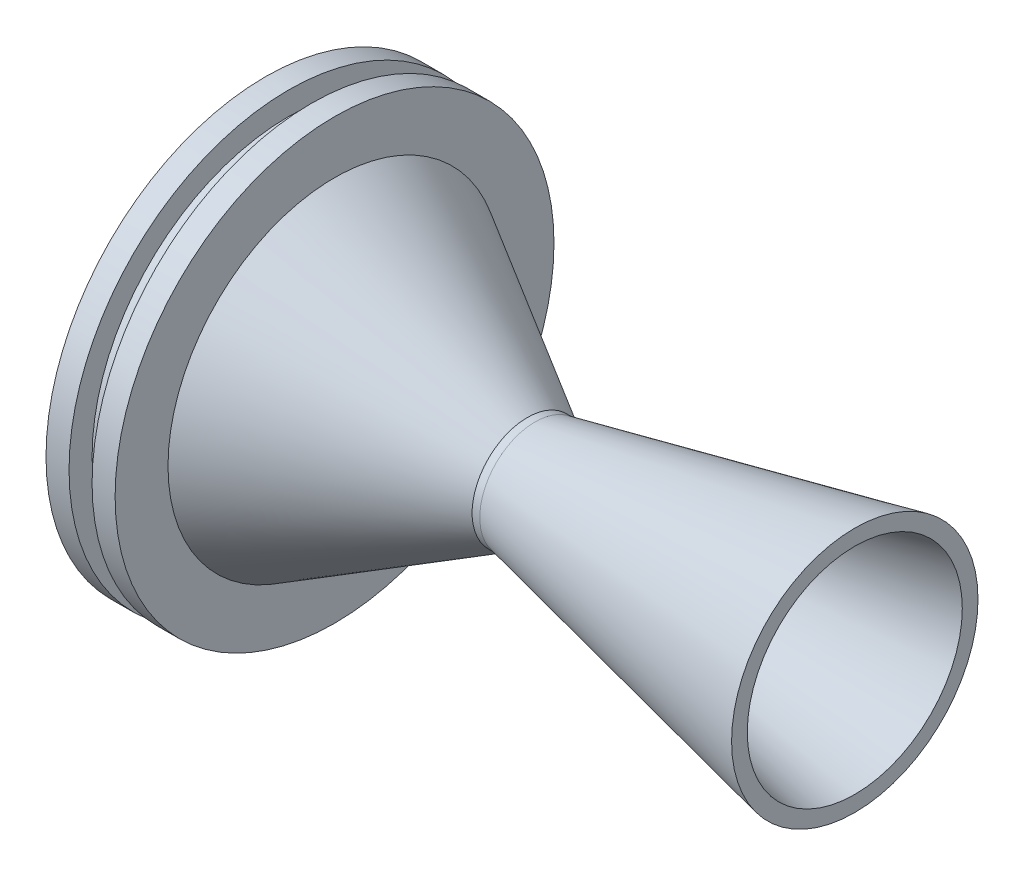
ISO-10303-21;
HEADER;
FILE_DESCRIPTION(('STEP AP214'),'2;1');
FILE_NAME('part.step','',(''),(''),'','','');
FILE_SCHEMA(('AUTOMOTIVE_DESIGN { 1 0 10303 214 1 1 1 1 }'));
ENDSEC;
DATA;
#1=APPLICATION_CONTEXT('core data for automotive mechanical design processes');
#2=APPLICATION_PROTOCOL_DEFINITION('international standard','automotive_design',2000,#1);
#3=PRODUCT_CONTEXT('',#1,'mechanical');
#4=PRODUCT('Part','Part','',(#3));
#5=PRODUCT_RELATED_PRODUCT_CATEGORY('part','',(#4));
#6=PRODUCT_DEFINITION_FORMATION('','',#4);
#7=PRODUCT_DEFINITION_CONTEXT('part definition',#1,'design');
#8=PRODUCT_DEFINITION('design','',#6,#7);
#9=PRODUCT_DEFINITION_SHAPE('','',#8);
#10=(LENGTH_UNIT() NAMED_UNIT(*) SI_UNIT(.MILLI.,.METRE.));
#11=(NAMED_UNIT(*) PLANE_ANGLE_UNIT() SI_UNIT($,.RADIAN.));
#12=(NAMED_UNIT(*) SI_UNIT($,.STERADIAN.) SOLID_ANGLE_UNIT());
#13=UNCERTAINTY_MEASURE_WITH_UNIT(LENGTH_MEASURE(1.E-05),#10,'distance_accuracy_value','');
#14=(GEOMETRIC_REPRESENTATION_CONTEXT(3) GLOBAL_UNCERTAINTY_ASSIGNED_CONTEXT((#13)) GLOBAL_UNIT_ASSIGNED_CONTEXT((#10,
#11,#12)) REPRESENTATION_CONTEXT('',''));
#15=CARTESIAN_POINT('',(0.,0.,0.));
#16=DIRECTION('',(0.,0.,1.));
#17=DIRECTION('',(1.,0.,0.));
#18=AXIS2_PLACEMENT_3D('',#15,#16,#17);
#19=CARTESIAN_POINT('',(0.,0.,0.));
#20=DIRECTION('',(1.,0.,0.));
#21=DIRECTION('',(0.,0.,-1.));
#22=AXIS2_PLACEMENT_3D('',#19,#20,#21);
#23=CYLINDRICAL_SURFACE('',#22,28.575);
#24=CARTESIAN_POINT('',(0.,0.,0.));
#25=DIRECTION('',(1.,0.,0.));
#26=DIRECTION('',(0.,0.,-1.));
#27=AXIS2_PLACEMENT_3D('',#24,#25,#26);
#28=CIRCLE('',#27,28.575);
#29=CARTESIAN_POINT('',(0.,0.,-28.575));
#30=VERTEX_POINT('',#29);
#31=EDGE_CURVE('E10',#30,#30,#28,.T.);
#32=ORIENTED_EDGE('',*,*,#31,.T.);
#33=EDGE_LOOP('',(#32));
#34=FACE_BOUND('',#33,.T.);
#35=CARTESIAN_POINT('',(3.,0.,0.));
#36=DIRECTION('',(1.,0.,0.));
#37=DIRECTION('',(0.,0.,-1.));
#38=AXIS2_PLACEMENT_3D('',#35,#36,#37);
#39=CIRCLE('',#38,28.575);
#40=CARTESIAN_POINT('',(3.,0.,-28.575));
#41=VERTEX_POINT('',#40);
#42=EDGE_CURVE('E85',#41,#41,#39,.T.);
#43=ORIENTED_EDGE('',*,*,#42,.F.);
#44=EDGE_LOOP('',(#43));
#45=FACE_BOUND('',#44,.T.);
#46=ADVANCED_FACE('F39',(#34,#45),#23,.T.);
#47=CARTESIAN_POINT('',(0.,28.575,0.));
#48=DIRECTION('',(-1.,0.,0.));
#49=DIRECTION('',(0.,0.,1.));
#50=AXIS2_PLACEMENT_3D('',#47,#48,#49);
#51=PLANE('',#50);
#52=CARTESIAN_POINT('',(0.,0.,0.));
#53=DIRECTION('',(1.,0.,0.));
#54=DIRECTION('',(0.,0.,-1.));
#55=AXIS2_PLACEMENT_3D('',#52,#53,#54);
#56=CIRCLE('',#55,24.575);
#57=CARTESIAN_POINT('',(0.,0.,-24.575));
#58=VERTEX_POINT('',#57);
#59=EDGE_CURVE('E45',#58,#58,#56,.T.);
#60=ORIENTED_EDGE('',*,*,#59,.T.);
#61=EDGE_LOOP('',(#60));
#62=FACE_BOUND('',#61,.T.);
#63=ORIENTED_EDGE('',*,*,#31,.F.);
#64=EDGE_LOOP('',(#63));
#65=FACE_BOUND('',#64,.T.);
#66=ADVANCED_FACE('F93',(#62,#65),#51,.T.);
#67=CARTESIAN_POINT('',(0.,0.,0.));
#68=DIRECTION('',(-1.,0.,0.));
#69=DIRECTION('',(0.,0.,1.));
#70=AXIS2_PLACEMENT_3D('',#67,#68,#69);
#71=CONICAL_SURFACE('',#70,24.575,0.523598775598301);
#72=CARTESIAN_POINT('',(33.9048945581615,0.,0.));
#73=DIRECTION('',(1.,0.,0.));
#74=DIRECTION('',(0.,0.,-1.));
#75=AXIS2_PLACEMENT_3D('',#72,#73,#74);
#76=CIRCLE('',#75,4.99999999999949);
#77=CARTESIAN_POINT('',(33.9048945581615,0.,-4.99999999999949));
#78=VERTEX_POINT('',#77);
#79=EDGE_CURVE('E49',#78,#78,#76,.T.);
#80=ORIENTED_EDGE('',*,*,#79,.T.);
#81=EDGE_LOOP('',(#80));
#82=FACE_BOUND('',#81,.T.);
#83=ORIENTED_EDGE('',*,*,#59,.F.);
#84=EDGE_LOOP('',(#83));
#85=FACE_BOUND('',#84,.T.);
#86=ADVANCED_FACE('F97',(#82,#85),#71,.F.);
#87=CARTESIAN_POINT('',(0.,0.,0.));
#88=DIRECTION('',(1.,0.,0.));
#89=DIRECTION('',(0.,0.,-1.));
#90=AXIS2_PLACEMENT_3D('',#87,#88,#89);
#91=CYLINDRICAL_SURFACE('',#90,4.99999999999962);
#92=CARTESIAN_POINT('',(34.4048945581617,0.,0.));
#93=DIRECTION('',(1.,0.,0.));
#94=DIRECTION('',(0.,0.,-1.));
#95=AXIS2_PLACEMENT_3D('',#92,#93,#94);
#96=CIRCLE('',#95,4.99999999999974);
#97=CARTESIAN_POINT('',(34.4048945581617,0.,-4.99999999999974));
#98=VERTEX_POINT('',#97);
#99=EDGE_CURVE('E53',#98,#98,#96,.T.);
#100=ORIENTED_EDGE('',*,*,#99,.T.);
#101=EDGE_LOOP('',(#100));
#102=FACE_BOUND('',#101,.T.);
#103=ORIENTED_EDGE('',*,*,#79,.F.);
#104=EDGE_LOOP('',(#103));
#105=FACE_BOUND('',#104,.T.);
#106=ADVANCED_FACE('F101',(#102,#105),#91,.F.);
#107=CARTESIAN_POINT('',(34.4048945581617,0.,0.));
#108=DIRECTION('',(1.,0.,0.));
#109=DIRECTION('',(0.,0.,-1.));
#110=AXIS2_PLACEMENT_3D('',#107,#108,#109);
#111=CONICAL_SURFACE('',#110,4.99999999999974,0.209439510239313);
#112=CARTESIAN_POINT('',(76.7465655434703,0.,0.));
#113=DIRECTION('',(1.,0.,0.));
#114=DIRECTION('',(0.,0.,-1.));
#115=AXIS2_PLACEMENT_3D('',#112,#113,#114);
#116=CIRCLE('',#115,14.);
#117=CARTESIAN_POINT('',(76.7465655434703,0.,-14.));
#118=VERTEX_POINT('',#117);
#119=EDGE_CURVE('E58',#118,#118,#116,.T.);
#120=ORIENTED_EDGE('',*,*,#119,.T.);
#121=EDGE_LOOP('',(#120));
#122=FACE_BOUND('',#121,.T.);
#123=ORIENTED_EDGE('',*,*,#99,.F.);
#124=EDGE_LOOP('',(#123));
#125=FACE_BOUND('',#124,.T.);
#126=ADVANCED_FACE('F108',(#122,#125),#111,.F.);
#127=CARTESIAN_POINT('',(76.7465655434703,14.,0.));
#128=DIRECTION('',(1.,0.,0.));
#129=DIRECTION('',(0.,0.,-1.));
#130=AXIS2_PLACEMENT_3D('',#127,#128,#129);
#131=PLANE('',#130);
#132=CARTESIAN_POINT('',(76.7465655434703,0.,0.));
#133=DIRECTION('',(1.,0.,0.));
#134=DIRECTION('',(0.,0.,-1.));
#135=AXIS2_PLACEMENT_3D('',#132,#133,#134);
#136=CIRCLE('',#135,16.0446811897301);
#137=CARTESIAN_POINT('',(76.7465655434703,0.,-16.0446811897301));
#138=VERTEX_POINT('',#137);
#139=EDGE_CURVE('E61',#138,#138,#136,.T.);
#140=ORIENTED_EDGE('',*,*,#139,.T.);
#141=EDGE_LOOP('',(#140));
#142=FACE_BOUND('',#141,.T.);
#143=ORIENTED_EDGE('',*,*,#119,.F.);
#144=EDGE_LOOP('',(#143));
#145=FACE_BOUND('',#144,.T.);
#146=ADVANCED_FACE('F112',(#142,#145),#131,.T.);
#147=CARTESIAN_POINT('',(76.7465655434703,0.,0.));
#148=DIRECTION('',(1.,0.,0.));
#149=DIRECTION('',(0.,0.,-1.));
#150=AXIS2_PLACEMENT_3D('',#147,#148,#149);
#151=CONICAL_SURFACE('',#150,16.0446811897301,0.209439510239314);
#152=CARTESIAN_POINT('',(35.1054772091827,0.,0.));
#153=DIRECTION('',(1.,0.,0.));
#154=DIRECTION('',(0.,0.,-1.));
#155=AXIS2_PLACEMENT_3D('',#152,#153,#154);
#156=CIRCLE('',#155,7.19359462919649);
#157=CARTESIAN_POINT('',(35.1054772091827,0.,-7.19359462919649));
#158=VERTEX_POINT('',#157);
#159=EDGE_CURVE('E64',#158,#158,#156,.T.);
#160=ORIENTED_EDGE('',*,*,#159,.T.);
#161=EDGE_LOOP('',(#160));
#162=FACE_BOUND('',#161,.T.);
#163=ORIENTED_EDGE('',*,*,#139,.F.);
#164=EDGE_LOOP('',(#163));
#165=FACE_BOUND('',#164,.T.);
#166=ADVANCED_FACE('F116',(#162,#165),#151,.T.);
#167=CARTESIAN_POINT('',(0.,0.,0.));
#168=DIRECTION('',(1.,0.,0.));
#169=DIRECTION('',(0.,0.,-1.));
#170=AXIS2_PLACEMENT_3D('',#167,#168,#169);
#171=CYLINDRICAL_SURFACE('',#170,7.19359462919649);
#172=CARTESIAN_POINT('',(34.1054772091827,0.,0.));
#173=DIRECTION('',(1.,0.,0.));
#174=DIRECTION('',(0.,0.,-1.));
#175=AXIS2_PLACEMENT_3D('',#172,#173,#174);
#176=CIRCLE('',#175,7.19359462919649);
#177=CARTESIAN_POINT('',(34.1054772091827,0.,-7.19359462919649));
#178=VERTEX_POINT('',#177);
#179=EDGE_CURVE('E67',#178,#178,#176,.T.);
#180=ORIENTED_EDGE('',*,*,#179,.T.);
#181=EDGE_LOOP('',(#180));
#182=FACE_BOUND('',#181,.T.);
#183=ORIENTED_EDGE('',*,*,#159,.F.);
#184=EDGE_LOOP('',(#183));
#185=FACE_BOUND('',#184,.T.);
#186=ADVANCED_FACE('F120',(#182,#185),#171,.T.);
#187=CARTESIAN_POINT('',(34.1054772091827,0.,0.));
#188=DIRECTION('',(-1.,0.,0.));
#189=DIRECTION('',(0.,0.,1.));
#190=AXIS2_PLACEMENT_3D('',#187,#188,#189);
#191=CONICAL_SURFACE('',#190,7.19359462919649,0.523598775598282);
#192=CARTESIAN_POINT('',(9.,0.,0.));
#193=DIRECTION('',(1.,0.,0.));
#194=DIRECTION('',(0.,0.,-1.));
#195=AXIS2_PLACEMENT_3D('',#192,#193,#194);
#196=CIRCLE('',#195,21.6882486540516);
#197=CARTESIAN_POINT('',(9.,0.,-21.6882486540516));
#198=VERTEX_POINT('',#197);
#199=EDGE_CURVE('E70',#198,#198,#196,.T.);
#200=ORIENTED_EDGE('',*,*,#199,.T.);
#201=EDGE_LOOP('',(#200));
#202=FACE_BOUND('',#201,.T.);
#203=ORIENTED_EDGE('',*,*,#179,.F.);
#204=EDGE_LOOP('',(#203));
#205=FACE_BOUND('',#204,.T.);
#206=ADVANCED_FACE('F124',(#202,#205),#191,.T.);
#207=CARTESIAN_POINT('',(9.,21.6882486540516,0.));
#208=DIRECTION('',(1.,0.,0.));
#209=DIRECTION('',(0.,0.,-1.));
#210=AXIS2_PLACEMENT_3D('',#207,#208,#209);
#211=PLANE('',#210);
#212=CARTESIAN_POINT('',(9.,0.,0.));
#213=DIRECTION('',(1.,0.,0.));
#214=DIRECTION('',(0.,0.,-1.));
#215=AXIS2_PLACEMENT_3D('',#212,#213,#214);
#216=CIRCLE('',#215,28.575);
#217=CARTESIAN_POINT('',(9.,0.,-28.575));
#218=VERTEX_POINT('',#217);
#219=EDGE_CURVE('E73',#218,#218,#216,.T.);
#220=ORIENTED_EDGE('',*,*,#219,.T.);
#221=EDGE_LOOP('',(#220));
#222=FACE_BOUND('',#221,.T.);
#223=ORIENTED_EDGE('',*,*,#199,.F.);
#224=EDGE_LOOP('',(#223));
#225=FACE_BOUND('',#224,.T.);
#226=ADVANCED_FACE('F128',(#222,#225),#211,.T.);
#227=CARTESIAN_POINT('',(0.,0.,0.));
#228=DIRECTION('',(1.,0.,0.));
#229=DIRECTION('',(0.,0.,-1.));
#230=AXIS2_PLACEMENT_3D('',#227,#228,#229);
#231=CYLINDRICAL_SURFACE('',#230,28.575);
#232=CARTESIAN_POINT('',(6.,0.,0.));
#233=DIRECTION('',(1.,0.,0.));
#234=DIRECTION('',(0.,0.,-1.));
#235=AXIS2_PLACEMENT_3D('',#232,#233,#234);
#236=CIRCLE('',#235,28.575);
#237=CARTESIAN_POINT('',(6.,0.,-28.575));
#238=VERTEX_POINT('',#237);
#239=EDGE_CURVE('E76',#238,#238,#236,.T.);
#240=ORIENTED_EDGE('',*,*,#239,.T.);
#241=EDGE_LOOP('',(#240));
#242=FACE_BOUND('',#241,.T.);
#243=ORIENTED_EDGE('',*,*,#219,.F.);
#244=EDGE_LOOP('',(#243));
#245=FACE_BOUND('',#244,.T.);
#246=ADVANCED_FACE('F132',(#242,#245),#231,.T.);
#247=CARTESIAN_POINT('',(6.,28.575,0.));
#248=DIRECTION('',(-1.,0.,0.));
#249=DIRECTION('',(0.,0.,1.));
#250=AXIS2_PLACEMENT_3D('',#247,#248,#249);
#251=PLANE('',#250);
#252=CARTESIAN_POINT('',(6.,0.,0.));
#253=DIRECTION('',(1.,0.,0.));
#254=DIRECTION('',(0.,0.,-1.));
#255=AXIS2_PLACEMENT_3D('',#252,#253,#254);
#256=CIRCLE('',#255,25.575);
#257=CARTESIAN_POINT('',(6.,0.,-25.575));
#258=VERTEX_POINT('',#257);
#259=EDGE_CURVE('E79',#258,#258,#256,.T.);
#260=ORIENTED_EDGE('',*,*,#259,.T.);
#261=EDGE_LOOP('',(#260));
#262=FACE_BOUND('',#261,.T.);
#263=ORIENTED_EDGE('',*,*,#239,.F.);
#264=EDGE_LOOP('',(#263));
#265=FACE_BOUND('',#264,.T.);
#266=ADVANCED_FACE('F136',(#262,#265),#251,.T.);
#267=CARTESIAN_POINT('',(0.,0.,0.));
#268=DIRECTION('',(1.,0.,0.));
#269=DIRECTION('',(0.,0.,-1.));
#270=AXIS2_PLACEMENT_3D('',#267,#268,#269);
#271=CYLINDRICAL_SURFACE('',#270,25.575);
#272=CARTESIAN_POINT('',(3.,0.,0.));
#273=DIRECTION('',(1.,0.,0.));
#274=DIRECTION('',(0.,0.,-1.));
#275=AXIS2_PLACEMENT_3D('',#272,#273,#274);
#276=CIRCLE('',#275,25.575);
#277=CARTESIAN_POINT('',(3.,0.,-25.575));
#278=VERTEX_POINT('',#277);
#279=EDGE_CURVE('E82',#278,#278,#276,.T.);
#280=ORIENTED_EDGE('',*,*,#279,.T.);
#281=EDGE_LOOP('',(#280));
#282=FACE_BOUND('',#281,.T.);
#283=ORIENTED_EDGE('',*,*,#259,.F.);
#284=EDGE_LOOP('',(#283));
#285=FACE_BOUND('',#284,.T.);
#286=ADVANCED_FACE('F140',(#282,#285),#271,.T.);
#287=CARTESIAN_POINT('',(3.,28.575,0.));
#288=DIRECTION('',(1.,0.,0.));
#289=DIRECTION('',(0.,0.,-1.));
#290=AXIS2_PLACEMENT_3D('',#287,#288,#289);
#291=PLANE('',#290);
#292=ORIENTED_EDGE('',*,*,#42,.T.);
#293=EDGE_LOOP('',(#292));
#294=FACE_BOUND('',#293,.T.);
#295=ORIENTED_EDGE('',*,*,#279,.F.);
#296=EDGE_LOOP('',(#295));
#297=FACE_BOUND('',#296,.T.);
#298=ADVANCED_FACE('F89',(#294,#297),#291,.T.);
#299=CLOSED_SHELL('',(#46,#66,#86,#106,#126,#146,#166,#186,#206,#226,#246,#266,#286,#298));
#300=MANIFOLD_SOLID_BREP('B2',#299);
#301=ADVANCED_BREP_SHAPE_REPRESENTATION('',(#18,#300),#14);
#302=SHAPE_DEFINITION_REPRESENTATION(#9,#301);
ENDSEC;
END-ISO-10303-21;
